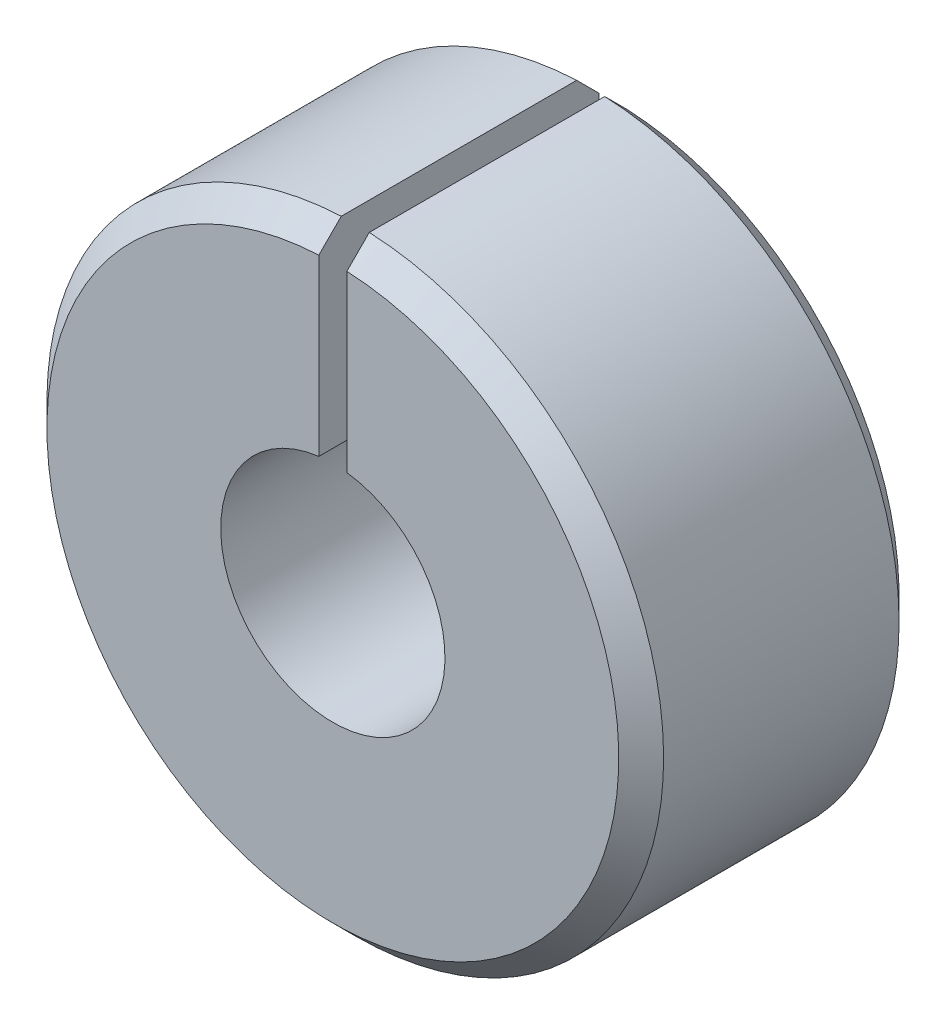
ISO-10303-21;
HEADER;
FILE_DESCRIPTION(('STEP AP214'),'2;1');
FILE_NAME('part.step','',(''),(''),'','','');
FILE_SCHEMA(('AUTOMOTIVE_DESIGN { 1 0 10303 214 1 1 1 1 }'));
ENDSEC;
DATA;
#1=APPLICATION_CONTEXT('core data for automotive mechanical design processes');
#2=APPLICATION_PROTOCOL_DEFINITION('international standard','automotive_design',2000,#1);
#3=PRODUCT_CONTEXT('',#1,'mechanical');
#4=PRODUCT('Part','Part','',(#3));
#5=PRODUCT_RELATED_PRODUCT_CATEGORY('part','',(#4));
#6=PRODUCT_DEFINITION_FORMATION('','',#4);
#7=PRODUCT_DEFINITION_CONTEXT('part definition',#1,'design');
#8=PRODUCT_DEFINITION('design','',#6,#7);
#9=PRODUCT_DEFINITION_SHAPE('','',#8);
#10=(LENGTH_UNIT() NAMED_UNIT(*) SI_UNIT(.MILLI.,.METRE.));
#11=(NAMED_UNIT(*) PLANE_ANGLE_UNIT() SI_UNIT($,.RADIAN.));
#12=(NAMED_UNIT(*) SI_UNIT($,.STERADIAN.) SOLID_ANGLE_UNIT());
#13=UNCERTAINTY_MEASURE_WITH_UNIT(LENGTH_MEASURE(1.E-05),#10,'distance_accuracy_value','');
#14=(GEOMETRIC_REPRESENTATION_CONTEXT(3) GLOBAL_UNCERTAINTY_ASSIGNED_CONTEXT((#13)) GLOBAL_UNIT_ASSIGNED_CONTEXT((#10,
#11,#12)) REPRESENTATION_CONTEXT('',''));
#15=CARTESIAN_POINT('',(0.,0.,0.));
#16=DIRECTION('',(0.,0.,1.));
#17=DIRECTION('',(1.,0.,0.));
#18=AXIS2_PLACEMENT_3D('',#15,#16,#17);
#19=CARTESIAN_POINT('',(0.,0.,3.96875));
#20=DIRECTION('',(0.,0.,-1.));
#21=DIRECTION('',(-1.,0.,0.));
#22=AXIS2_PLACEMENT_3D('',#19,#20,#21);
#23=CYLINDRICAL_SURFACE('',#22,3.175);
#24=CARTESIAN_POINT('',(0.,0.,-3.96875));
#25=DIRECTION('',(0.,0.,-1.));
#26=DIRECTION('',(1.,0.,0.));
#27=AXIS2_PLACEMENT_3D('',#24,#25,#26);
#28=CIRCLE('',#27,3.175);
#29=CARTESIAN_POINT('',(0.396875000000003,3.15009765473628,-3.96875));
#30=VERTEX_POINT('',#29);
#31=CARTESIAN_POINT('',(-0.396874999999996,3.15009765473628,-3.96875));
#32=VERTEX_POINT('',#31);
#33=EDGE_CURVE('E109',#30,#32,#28,.T.);
#34=ORIENTED_EDGE('',*,*,#33,.T.);
#35=DIRECTION('',(0.,0.,-1.));
#36=VECTOR('',#35,1.);
#37=CARTESIAN_POINT('',(-0.396874999999996,3.15009765473628,3.96875));
#38=LINE('',#37,#36);
#39=CARTESIAN_POINT('',(-0.396874999999996,3.15009765473628,3.96875));
#40=VERTEX_POINT('',#39);
#41=EDGE_CURVE('E93',#40,#32,#38,.T.);
#42=ORIENTED_EDGE('',*,*,#41,.F.);
#43=CARTESIAN_POINT('',(0.,0.,3.96875));
#44=DIRECTION('',(0.,0.,-1.));
#45=DIRECTION('',(1.,0.,0.));
#46=AXIS2_PLACEMENT_3D('',#43,#44,#45);
#47=CIRCLE('',#46,3.175);
#48=CARTESIAN_POINT('',(0.396875000000003,3.15009765473628,3.96875));
#49=VERTEX_POINT('',#48);
#50=EDGE_CURVE('E98',#49,#40,#47,.T.);
#51=ORIENTED_EDGE('',*,*,#50,.F.);
#52=DIRECTION('',(0.,0.,-1.));
#53=VECTOR('',#52,1.);
#54=CARTESIAN_POINT('',(0.396875000000003,3.15009765473628,3.96875));
#55=LINE('',#54,#53);
#56=EDGE_CURVE('E225',#49,#30,#55,.T.);
#57=ORIENTED_EDGE('',*,*,#56,.T.);
#58=EDGE_LOOP('',(#34,#42,#51,#57));
#59=FACE_BOUND('',#58,.T.);
#60=ADVANCED_FACE('F35',(#59),#23,.F.);
#61=CARTESIAN_POINT('',(-0.396874999999996,3.15009765473628,3.96875));
#62=DIRECTION('',(-1.,0.,0.));
#63=DIRECTION('',(0.,-1.,0.));
#64=AXIS2_PLACEMENT_3D('',#61,#62,#63);
#65=PLANE('',#64);
#66=DIRECTION('',(0.,1.,0.));
#67=VECTOR('',#66,1.);
#68=CARTESIAN_POINT('',(-0.396874999999996,3.15009765473628,-3.96875));
#69=LINE('',#68,#67);
#70=CARTESIAN_POINT('',(-0.396874999999997,8.08651682103456,-3.96875));
#71=VERTEX_POINT('',#70);
#72=EDGE_CURVE('E217',#32,#71,#69,.T.);
#73=ORIENTED_EDGE('',*,*,#72,.T.);
#74=CARTESIAN_POINT('',(-0.396874999999997,8.08651682103456,-3.96875));
#75=CARTESIAN_POINT('',(-0.396874999999997,8.19247271842999,-3.86292113090982));
#76=CARTESIAN_POINT('',(-0.396874999999997,8.29842638619112,-3.75709002969717));
#77=CARTESIAN_POINT('',(-0.396874999999998,8.51032926244122,-3.54542336303051));
#78=CARTESIAN_POINT('',(-0.396874999999998,8.6162784709302,-3.43958779757648));
#79=CARTESIAN_POINT('',(-0.396874999999998,8.72222544978488,-3.33375));
#80=B_SPLINE_CURVE_WITH_KNOTS('',3,(#74,#75,#76,#77,#78,#79),.UNSPECIFIED.,.F.,.F.,(4,2,4),(0.,
0.44926341411609,0.898526828217131),.UNSPECIFIED.);
#81=CARTESIAN_POINT('',(-0.396874999999998,8.72222544978488,-3.33375));
#82=VERTEX_POINT('',#81);
#83=EDGE_CURVE('E44',#71,#82,#80,.T.);
#84=ORIENTED_EDGE('',*,*,#83,.T.);
#85=DIRECTION('',(0.,0.,-1.));
#86=VECTOR('',#85,1.);
#87=CARTESIAN_POINT('',(-0.396874999999998,8.72222544978488,3.96875));
#88=LINE('',#87,#86);
#89=CARTESIAN_POINT('',(-0.396874999999998,8.72222544978488,3.33375));
#90=VERTEX_POINT('',#89);
#91=EDGE_CURVE('E111',#90,#82,#88,.T.);
#92=ORIENTED_EDGE('',*,*,#91,.F.);
#93=CARTESIAN_POINT('',(-0.396874999999998,8.72222544978488,3.33375));
#94=CARTESIAN_POINT('',(-0.396874999999998,8.6162784709302,3.43958779757648));
#95=CARTESIAN_POINT('',(-0.396874999999998,8.51032926244122,3.54542336303051));
#96=CARTESIAN_POINT('',(-0.396874999999997,8.29842638619112,3.75709002969717));
#97=CARTESIAN_POINT('',(-0.396874999999997,8.19247271842999,3.86292113090982));
#98=CARTESIAN_POINT('',(-0.396874999999997,8.08651682103457,3.96875));
#99=B_SPLINE_CURVE_WITH_KNOTS('',3,(#93,#94,#95,#96,#97,#98),.UNSPECIFIED.,.F.,.F.,(4,2,4),(0.,
0.449263414101038,0.898526828217126),.UNSPECIFIED.);
#100=CARTESIAN_POINT('',(-0.396874999999997,8.08651682103456,3.96875));
#101=VERTEX_POINT('',#100);
#102=EDGE_CURVE('E51',#90,#101,#99,.T.);
#103=ORIENTED_EDGE('',*,*,#102,.T.);
#104=DIRECTION('',(0.,1.,0.));
#105=VECTOR('',#104,1.);
#106=CARTESIAN_POINT('',(-0.396874999999996,3.15009765473628,3.96875));
#107=LINE('',#106,#105);
#108=EDGE_CURVE('E89',#40,#101,#107,.T.);
#109=ORIENTED_EDGE('',*,*,#108,.F.);
#110=ORIENTED_EDGE('',*,*,#41,.T.);
#111=EDGE_LOOP('',(#73,#84,#92,#103,#109,#110));
#112=FACE_BOUND('',#111,.T.);
#113=ADVANCED_FACE('F91',(#112),#65,.F.);
#114=CARTESIAN_POINT('',(0.,0.,3.96875));
#115=DIRECTION('',(0.,0.,-1.));
#116=DIRECTION('',(-1.,0.,0.));
#117=AXIS2_PLACEMENT_3D('',#114,#115,#116);
#118=CYLINDRICAL_SURFACE('',#117,8.73125);
#119=ORIENTED_EDGE('',*,*,#91,.T.);
#120=CARTESIAN_POINT('',(0.,0.,-3.33375));
#121=DIRECTION('',(0.,0.,1.));
#122=DIRECTION('',(1.,0.,0.));
#123=AXIS2_PLACEMENT_3D('',#120,#121,#122);
#124=CIRCLE('',#123,8.73125);
#125=CARTESIAN_POINT('',(0.396875000000005,8.72222544978488,-3.33375));
#126=VERTEX_POINT('',#125);
#127=EDGE_CURVE('E113',#82,#126,#124,.T.);
#128=ORIENTED_EDGE('',*,*,#127,.T.);
#129=DIRECTION('',(0.,0.,-1.));
#130=VECTOR('',#129,1.);
#131=CARTESIAN_POINT('',(0.396875000000005,8.72222544978488,3.96875));
#132=LINE('',#131,#130);
#133=CARTESIAN_POINT('',(0.396875000000005,8.72222544978488,3.33375));
#134=VERTEX_POINT('',#133);
#135=EDGE_CURVE('E116',#134,#126,#132,.T.);
#136=ORIENTED_EDGE('',*,*,#135,.F.);
#137=CARTESIAN_POINT('',(0.,0.,3.33375));
#138=DIRECTION('',(0.,0.,1.));
#139=DIRECTION('',(1.,0.,0.));
#140=AXIS2_PLACEMENT_3D('',#137,#138,#139);
#141=CIRCLE('',#140,8.73125);
#142=EDGE_CURVE('E110',#134,#90,#141,.F.);
#143=ORIENTED_EDGE('',*,*,#142,.T.);
#144=EDGE_LOOP('',(#119,#128,#136,#143));
#145=FACE_BOUND('',#144,.T.);
#146=ADVANCED_FACE('F138',(#145),#118,.T.);
#147=CARTESIAN_POINT('',(0.396875000000003,3.15009765473628,3.96875));
#148=DIRECTION('',(1.,0.,0.));
#149=DIRECTION('',(0.,1.,0.));
#150=AXIS2_PLACEMENT_3D('',#147,#148,#149);
#151=PLANE('',#150);
#152=ORIENTED_EDGE('',*,*,#135,.T.);
#153=CARTESIAN_POINT('',(0.396875000000005,8.72222544978488,-3.33375));
#154=CARTESIAN_POINT('',(0.396875000000004,8.6162784709302,-3.43958779757648));
#155=CARTESIAN_POINT('',(0.396875000000004,8.51032926244122,-3.54542336303051));
#156=CARTESIAN_POINT('',(0.396875000000003,8.29842638619112,-3.75709002969717));
#157=CARTESIAN_POINT('',(0.396875000000003,8.19247271842999,-3.86292113090982));
#158=CARTESIAN_POINT('',(0.396875000000003,8.08651682103456,-3.96875));
#159=B_SPLINE_CURVE_WITH_KNOTS('',3,(#153,#154,#155,#156,#157,#158),.UNSPECIFIED.,.F.,.F.,(4,2,
4),(0.,0.449263414101042,0.898526828217132),.UNSPECIFIED.);
#160=CARTESIAN_POINT('',(0.396875000000003,8.08651682103456,-3.96875));
#161=VERTEX_POINT('',#160);
#162=EDGE_CURVE('E128',#126,#161,#159,.T.);
#163=ORIENTED_EDGE('',*,*,#162,.T.);
#164=DIRECTION('',(0.,-1.,0.));
#165=VECTOR('',#164,1.);
#166=CARTESIAN_POINT('',(0.396875000000003,3.15009765473628,-3.96875));
#167=LINE('',#166,#165);
#168=EDGE_CURVE('E106',#161,#30,#167,.T.);
#169=ORIENTED_EDGE('',*,*,#168,.T.);
#170=ORIENTED_EDGE('',*,*,#56,.F.);
#171=DIRECTION('',(0.,-1.,0.));
#172=VECTOR('',#171,1.);
#173=CARTESIAN_POINT('',(0.396875000000003,3.15009765473628,3.96875));
#174=LINE('',#173,#172);
#175=CARTESIAN_POINT('',(0.396875000000003,8.08651682103456,3.96875));
#176=VERTEX_POINT('',#175);
#177=EDGE_CURVE('E97',#176,#49,#174,.T.);
#178=ORIENTED_EDGE('',*,*,#177,.F.);
#179=CARTESIAN_POINT('',(0.396875000000003,8.08651682103456,3.96875));
#180=CARTESIAN_POINT('',(0.396875000000003,8.19247271842999,3.86292113090982));
#181=CARTESIAN_POINT('',(0.396875000000003,8.29842638619112,3.75709002969717));
#182=CARTESIAN_POINT('',(0.396875000000003,8.51032926244122,3.54542336303051));
#183=CARTESIAN_POINT('',(0.396875000000003,8.6162784709302,3.43958779757649));
#184=CARTESIAN_POINT('',(0.396875000000003,8.72222544978488,3.33375));
#185=B_SPLINE_CURVE_WITH_KNOTS('',3,(#179,#180,#181,#182,#183,#184),.UNSPECIFIED.,.F.,.F.,(4,2,
4),(0.,0.449263414116089,0.898526828217127),.UNSPECIFIED.);
#186=EDGE_CURVE('E122',#176,#134,#185,.T.);
#187=ORIENTED_EDGE('',*,*,#186,.T.);
#188=EDGE_LOOP('',(#152,#163,#169,#170,#178,#187));
#189=FACE_BOUND('',#188,.T.);
#190=ADVANCED_FACE('F133',(#189),#151,.F.);
#191=CARTESIAN_POINT('',(0.,0.,3.96875));
#192=DIRECTION('',(0.,0.,1.));
#193=DIRECTION('',(1.,0.,0.));
#194=AXIS2_PLACEMENT_3D('',#191,#192,#193);
#195=PLANE('',#194);
#196=ORIENTED_EDGE('',*,*,#108,.T.);
#197=CARTESIAN_POINT('',(0.,0.,3.96875));
#198=DIRECTION('',(0.,0.,1.));
#199=DIRECTION('',(1.,0.,0.));
#200=AXIS2_PLACEMENT_3D('',#197,#198,#199);
#201=CIRCLE('',#200,8.09625);
#202=EDGE_CURVE('E11',#101,#176,#201,.T.);
#203=ORIENTED_EDGE('',*,*,#202,.T.);
#204=ORIENTED_EDGE('',*,*,#177,.T.);
#205=ORIENTED_EDGE('',*,*,#50,.T.);
#206=EDGE_LOOP('',(#196,#203,#204,#205));
#207=FACE_BOUND('',#206,.T.);
#208=ADVANCED_FACE('F101',(#207),#195,.T.);
#209=CARTESIAN_POINT('',(0.,0.,-3.96875));
#210=DIRECTION('',(0.,0.,1.));
#211=DIRECTION('',(1.,0.,0.));
#212=AXIS2_PLACEMENT_3D('',#209,#210,#211);
#213=PLANE('',#212);
#214=ORIENTED_EDGE('',*,*,#168,.F.);
#215=CARTESIAN_POINT('',(0.,0.,-3.96875));
#216=DIRECTION('',(0.,0.,1.));
#217=DIRECTION('',(1.,0.,0.));
#218=AXIS2_PLACEMENT_3D('',#215,#216,#217);
#219=CIRCLE('',#218,8.09625);
#220=EDGE_CURVE('E59',#161,#71,#219,.F.);
#221=ORIENTED_EDGE('',*,*,#220,.T.);
#222=ORIENTED_EDGE('',*,*,#72,.F.);
#223=ORIENTED_EDGE('',*,*,#33,.F.);
#224=EDGE_LOOP('',(#214,#221,#222,#223));
#225=FACE_BOUND('',#224,.T.);
#226=ADVANCED_FACE('F140',(#225),#213,.F.);
#227=CARTESIAN_POINT('',(0.,0.,-3.33375));
#228=DIRECTION('',(0.,0.,1.));
#229=DIRECTION('',(1.,0.,0.));
#230=AXIS2_PLACEMENT_3D('',#227,#228,#229);
#231=CONICAL_SURFACE('',#230,8.73125,0.78539816339745);
#232=ORIENTED_EDGE('',*,*,#83,.F.);
#233=ORIENTED_EDGE('',*,*,#220,.F.);
#234=ORIENTED_EDGE('',*,*,#162,.F.);
#235=ORIENTED_EDGE('',*,*,#127,.F.);
#236=EDGE_LOOP('',(#232,#233,#234,#235));
#237=FACE_BOUND('',#236,.T.);
#238=ADVANCED_FACE('F157',(#237),#231,.T.);
#239=CARTESIAN_POINT('',(0.,0.,3.96875));
#240=DIRECTION('',(0.,0.,-1.));
#241=DIRECTION('',(-1.,0.,0.));
#242=AXIS2_PLACEMENT_3D('',#239,#240,#241);
#243=CONICAL_SURFACE('',#242,8.09625,0.785398163397448);
#244=ORIENTED_EDGE('',*,*,#102,.F.);
#245=ORIENTED_EDGE('',*,*,#142,.F.);
#246=ORIENTED_EDGE('',*,*,#186,.F.);
#247=ORIENTED_EDGE('',*,*,#202,.F.);
#248=EDGE_LOOP('',(#244,#245,#246,#247));
#249=FACE_BOUND('',#248,.T.);
#250=ADVANCED_FACE('F37',(#249),#243,.T.);
#251=CLOSED_SHELL('',(#60,#113,#146,#190,#208,#226,#238,#250));
#252=MANIFOLD_SOLID_BREP('B2',#251);
#253=ADVANCED_BREP_SHAPE_REPRESENTATION('',(#18,#252),#14);
#254=SHAPE_DEFINITION_REPRESENTATION(#9,#253);
ENDSEC;
END-ISO-10303-21;
